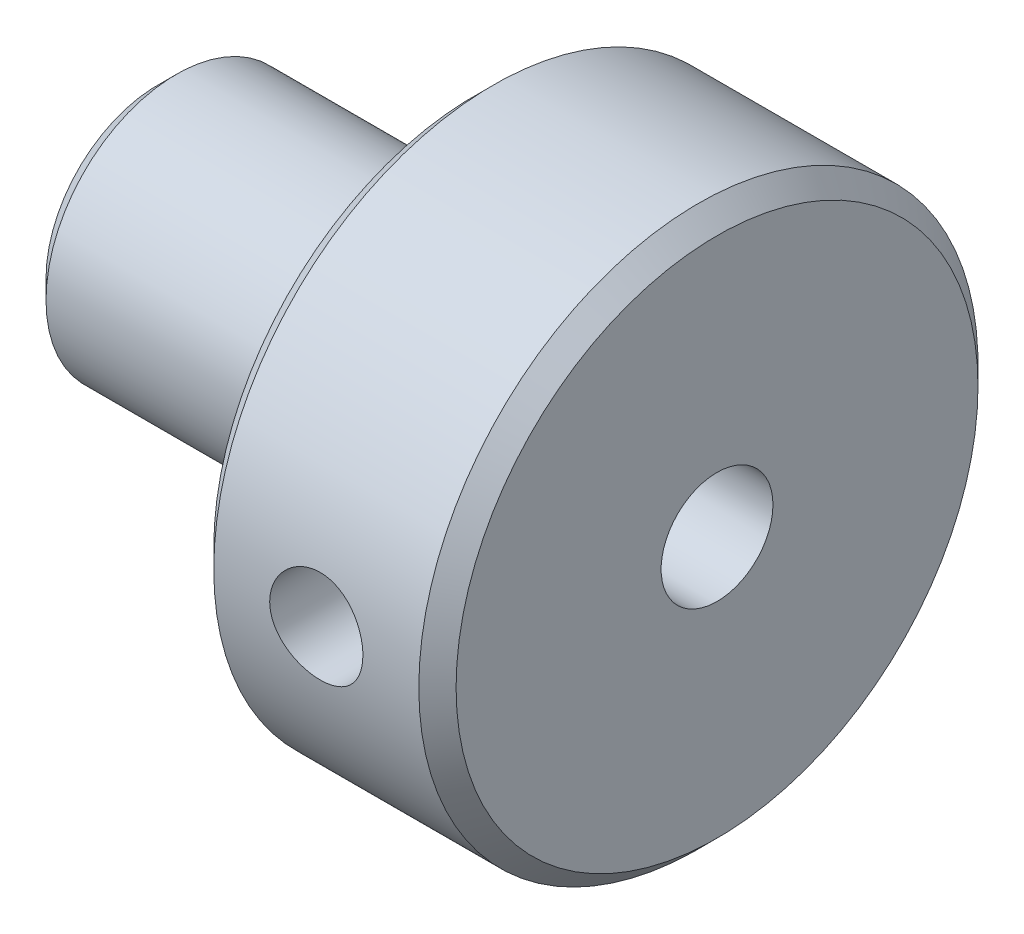
ISO-10303-21;
HEADER;
FILE_DESCRIPTION(('STEP AP214'),'2;1');
FILE_NAME('part.step','',(''),(''),'','','');
FILE_SCHEMA(('AUTOMOTIVE_DESIGN { 1 0 10303 214 1 1 1 1 }'));
ENDSEC;
DATA;
#1=APPLICATION_CONTEXT('core data for automotive mechanical design processes');
#2=APPLICATION_PROTOCOL_DEFINITION('international standard','automotive_design',2000,#1);
#3=PRODUCT_CONTEXT('',#1,'mechanical');
#4=PRODUCT('Part','Part','',(#3));
#5=PRODUCT_RELATED_PRODUCT_CATEGORY('part','',(#4));
#6=PRODUCT_DEFINITION_FORMATION('','',#4);
#7=PRODUCT_DEFINITION_CONTEXT('part definition',#1,'design');
#8=PRODUCT_DEFINITION('design','',#6,#7);
#9=PRODUCT_DEFINITION_SHAPE('','',#8);
#10=(LENGTH_UNIT() NAMED_UNIT(*) SI_UNIT(.MILLI.,.METRE.));
#11=(NAMED_UNIT(*) PLANE_ANGLE_UNIT() SI_UNIT($,.RADIAN.));
#12=(NAMED_UNIT(*) SI_UNIT($,.STERADIAN.) SOLID_ANGLE_UNIT());
#13=UNCERTAINTY_MEASURE_WITH_UNIT(LENGTH_MEASURE(1.E-05),#10,'distance_accuracy_value','');
#14=(GEOMETRIC_REPRESENTATION_CONTEXT(3) GLOBAL_UNCERTAINTY_ASSIGNED_CONTEXT((#13)) GLOBAL_UNIT_ASSIGNED_CONTEXT((#10,
#11,#12)) REPRESENTATION_CONTEXT('',''));
#15=CARTESIAN_POINT('',(0.,0.,0.));
#16=DIRECTION('',(0.,0.,1.));
#17=DIRECTION('',(1.,0.,0.));
#18=AXIS2_PLACEMENT_3D('',#15,#16,#17);
#19=CARTESIAN_POINT('',(12.,0.,0.));
#20=DIRECTION('',(1.,0.,0.));
#21=DIRECTION('',(0.,0.,-1.));
#22=AXIS2_PLACEMENT_3D('',#19,#20,#21);
#23=CONICAL_SURFACE('',#22,1.5,1.02974425867665);
#24=CARTESIAN_POINT('',(12.,0.,0.));
#25=DIRECTION('',(1.,0.,0.));
#26=DIRECTION('',(0.,0.,-1.));
#27=AXIS2_PLACEMENT_3D('',#24,#25,#26);
#28=CIRCLE('',#27,1.5);
#29=CARTESIAN_POINT('',(12.,1.22474487139158,-0.866025403784387));
#30=VERTEX_POINT('',#29);
#31=CARTESIAN_POINT('',(12.,1.22474487139158,0.86602540378438));
#32=VERTEX_POINT('',#31);
#33=EDGE_CURVE('E150',#30,#32,#28,.T.);
#34=ORIENTED_EDGE('',*,*,#33,.T.);
#35=CARTESIAN_POINT('',(12.0903290928541,1.20277849521725,1.13000992327246));
#36=CARTESIAN_POINT('',(12.0726709393552,1.207780261198,1.08173671480113));
#37=CARTESIAN_POINT('',(12.055465042387,1.21222328298894,1.03323553354087));
#38=CARTESIAN_POINT('',(12.0222688610693,1.22010554615955,0.935708084563557));
#39=CARTESIAN_POINT('',(12.0062792759134,1.22354421336571,0.886681533037432));
#40=CARTESIAN_POINT('',(11.9757051422171,1.2295540438813,0.787627333599846));
#41=CARTESIAN_POINT('',(11.9611351611816,1.23211677760813,0.737594609868152));
#42=CARTESIAN_POINT('',(11.9339984280022,1.23645962427981,0.636970096007255));
#43=CARTESIAN_POINT('',(11.9214313946502,1.23823984714875,0.586378385426606));
#44=CARTESIAN_POINT('',(11.8885579137259,1.24248982244376,0.438507900738185));
#45=CARTESIAN_POINT('',(11.8715362972373,1.24412617882776,0.340402103935049));
#46=CARTESIAN_POINT('',(11.8554351857621,1.24555610808899,0.192455729296244));
#47=CARTESIAN_POINT('',(11.8516381332759,1.24586241998786,0.143116629639939));
#48=CARTESIAN_POINT('',(11.8473916638511,1.24620241589911,0.0442893328968177));
#49=CARTESIAN_POINT('',(11.8469419909312,1.24623612075836,-0.00519885249954363));
#50=CARTESIAN_POINT('',(11.8493164928811,1.24604852122718,-0.0997396529202935));
#51=CARTESIAN_POINT('',(11.8518564160113,1.24584936821413,-0.144799848791723));
#52=CARTESIAN_POINT('',(11.8595994427884,1.24519186445326,-0.23469248591188));
#53=CARTESIAN_POINT('',(11.8648031217615,1.24473345770878,-0.279524875844917));
#54=CARTESIAN_POINT('',(11.8840655529884,1.2428571370959,-0.413847678037669));
#55=CARTESIAN_POINT('',(11.9017636190825,1.24093782523646,-0.502819570822946));
#56=CARTESIAN_POINT('',(11.9340141353927,1.23643153721397,-0.636890825517909));
#57=CARTESIAN_POINT('',(11.9460395264198,1.23459986237526,-0.682671625257696));
#58=CARTESIAN_POINT('',(11.9716433411002,1.23026139630203,-0.773774506696456));
#59=CARTESIAN_POINT('',(11.9852219115146,1.22775454123889,-0.819096544605541));
#60=CARTESIAN_POINT('',(12.0135084967134,1.22199401778531,-0.908925089979669));
#61=CARTESIAN_POINT('',(12.0282063577758,1.21874662973513,-0.953435236221209));
#62=CARTESIAN_POINT('',(12.0585868598887,1.21141256629929,-1.04202977060238));
#63=CARTESIAN_POINT('',(12.0742691184114,1.20732621554225,-1.08611431653643));
#64=CARTESIAN_POINT('',(12.0903290928541,1.20277849521725,-1.13000992327246));
#65=B_SPLINE_CURVE_WITH_KNOTS('',3,(#35,#36,#37,#38,#39,#40,#41,#42,#43,#44,#45,#46,#47,#48,#49,
#50,#51,#52,#53,#54,#55,#56,#57,#58,#59,#60,#61,#62,#63,#64),.UNSPECIFIED.,.F.,.F.,(4,2,2,2,2,2,
2,2,2,2,2,2,2,2,4),(0.,0.154933250869943,0.30995490202225,0.466428967443399,0.622881044963881,
0.920883529748979,1.06924390241435,1.21759292953019,1.35290417246563,1.48824465268112,
1.75995275217618,1.90204235011993,2.04414538532002,2.18508535616897,2.32597089407399),.UNSPECIFIED.);
#66=EDGE_CURVE('E109',#32,#30,#65,.T.);
#67=ORIENTED_EDGE('',*,*,#66,.T.);
#68=EDGE_LOOP('',(#34,#67));
#69=FACE_BOUND('',#68,.T.);
#70=ADVANCED_FACE('F39',(#69),#23,.F.);
#71=CARTESIAN_POINT('',(0.,0.,0.));
#72=DIRECTION('',(1.,0.,0.));
#73=DIRECTION('',(0.,0.,-1.));
#74=AXIS2_PLACEMENT_3D('',#71,#72,#73);
#75=PLANE('',#74);
#76=CARTESIAN_POINT('',(0.,0.,0.));
#77=DIRECTION('',(1.,0.,0.));
#78=DIRECTION('',(0.,0.,-1.));
#79=AXIS2_PLACEMENT_3D('',#76,#77,#78);
#80=CIRCLE('',#79,3.);
#81=CARTESIAN_POINT('',(0.,0.,-3.));
#82=VERTEX_POINT('',#81);
#83=EDGE_CURVE('E197',#82,#82,#80,.F.);
#84=ORIENTED_EDGE('',*,*,#83,.T.);
#85=EDGE_LOOP('',(#84));
#86=FACE_BOUND('',#85,.T.);
#87=CARTESIAN_POINT('',(0.,0.,0.));
#88=DIRECTION('',(-1.,0.,0.));
#89=DIRECTION('',(0.,0.,1.));
#90=AXIS2_PLACEMENT_3D('',#87,#88,#89);
#91=CIRCLE('',#90,1.24999999999999);
#92=CARTESIAN_POINT('',(0.,0.,1.24999999999999));
#93=VERTEX_POINT('',#92);
#94=EDGE_CURVE('E153',#93,#93,#91,.T.);
#95=ORIENTED_EDGE('',*,*,#94,.F.);
#96=EDGE_LOOP('',(#95));
#97=FACE_BOUND('',#96,.T.);
#98=ADVANCED_FACE('F170',(#86,#97),#75,.F.);
#99=CARTESIAN_POINT('',(0.,0.,0.));
#100=DIRECTION('',(-1.,0.,0.));
#101=DIRECTION('',(0.,0.,1.));
#102=AXIS2_PLACEMENT_3D('',#99,#100,#101);
#103=CYLINDRICAL_SURFACE('',#102,3.5);
#104=CARTESIAN_POINT('',(0.500000000000003,0.,0.));
#105=DIRECTION('',(1.,0.,0.));
#106=DIRECTION('',(0.,0.,-1.));
#107=AXIS2_PLACEMENT_3D('',#104,#105,#106);
#108=CIRCLE('',#107,3.5);
#109=CARTESIAN_POINT('',(0.500000000000003,0.,-3.5));
#110=VERTEX_POINT('',#109);
#111=EDGE_CURVE('E47',#110,#110,#108,.T.);
#112=ORIENTED_EDGE('',*,*,#111,.T.);
#113=EDGE_LOOP('',(#112));
#114=FACE_BOUND('',#113,.T.);
#115=CARTESIAN_POINT('',(8.5,0.,0.));
#116=DIRECTION('',(-1.,0.,0.));
#117=DIRECTION('',(0.,0.,1.));
#118=AXIS2_PLACEMENT_3D('',#115,#116,#117);
#119=CIRCLE('',#118,3.5);
#120=CARTESIAN_POINT('',(8.5,0.,3.5));
#121=VERTEX_POINT('',#120);
#122=EDGE_CURVE('E158',#121,#121,#119,.T.);
#123=ORIENTED_EDGE('',*,*,#122,.T.);
#124=EDGE_LOOP('',(#123));
#125=FACE_BOUND('',#124,.T.);
#126=ADVANCED_FACE('F174',(#114,#125),#103,.T.);
#127=CARTESIAN_POINT('',(8.5,3.5,0.));
#128=DIRECTION('',(1.,0.,0.));
#129=DIRECTION('',(0.,0.,-1.));
#130=AXIS2_PLACEMENT_3D('',#127,#128,#129);
#131=PLANE('',#130);
#132=CARTESIAN_POINT('',(8.5,0.,0.));
#133=DIRECTION('',(1.,0.,0.));
#134=DIRECTION('',(0.,0.,-1.));
#135=AXIS2_PLACEMENT_3D('',#132,#133,#134);
#136=CIRCLE('',#135,7.);
#137=CARTESIAN_POINT('',(8.5,0.,-7.));
#138=VERTEX_POINT('',#137);
#139=EDGE_CURVE('E11',#138,#138,#136,.F.);
#140=ORIENTED_EDGE('',*,*,#139,.T.);
#141=EDGE_LOOP('',(#140));
#142=FACE_BOUND('',#141,.T.);
#143=ORIENTED_EDGE('',*,*,#122,.F.);
#144=EDGE_LOOP('',(#143));
#145=FACE_BOUND('',#144,.T.);
#146=ADVANCED_FACE('F138',(#142,#145),#131,.F.);
#147=CARTESIAN_POINT('',(0.,0.,0.));
#148=DIRECTION('',(-1.,0.,0.));
#149=DIRECTION('',(0.,0.,1.));
#150=AXIS2_PLACEMENT_3D('',#147,#148,#149);
#151=CYLINDRICAL_SURFACE('',#150,7.5);
#152=CARTESIAN_POINT('',(14.5,0.,0.));
#153=DIRECTION('',(-1.,0.,0.));
#154=DIRECTION('',(0.,0.,1.));
#155=AXIS2_PLACEMENT_3D('',#152,#153,#154);
#156=CIRCLE('',#155,7.5);
#157=CARTESIAN_POINT('',(14.5,0.,7.5));
#158=VERTEX_POINT('',#157);
#159=EDGE_CURVE('E201',#158,#158,#156,.T.);
#160=ORIENTED_EDGE('',*,*,#159,.T.);
#161=EDGE_LOOP('',(#160));
#162=FACE_BOUND('',#161,.T.);
#163=CARTESIAN_POINT('',(9.,0.,0.));
#164=DIRECTION('',(1.,0.,0.));
#165=DIRECTION('',(0.,0.,-1.));
#166=AXIS2_PLACEMENT_3D('',#163,#164,#165);
#167=CIRCLE('',#166,7.5);
#168=CARTESIAN_POINT('',(9.,0.,-7.5));
#169=VERTEX_POINT('',#168);
#170=EDGE_CURVE('E115',#169,#169,#167,.T.);
#171=ORIENTED_EDGE('',*,*,#170,.T.);
#172=EDGE_LOOP('',(#171));
#173=FACE_BOUND('',#172,.T.);
#174=CARTESIAN_POINT('',(13.,0.,7.5));
#175=CARTESIAN_POINT('',(12.9999972055261,-0.069695452479107,7.49999880584412));
#176=CARTESIAN_POINT('',(12.9941513625155,-0.13942894091941,7.49901838956517));
#177=CARTESIAN_POINT('',(12.9709321706173,-0.27694011083652,7.49520172470694));
#178=CARTESIAN_POINT('',(12.9535482215442,-0.344715933979622,7.49236376961945));
#179=CARTESIAN_POINT('',(12.9077922757036,-0.47630237360632,7.48515034118225));
#180=CARTESIAN_POINT('',(12.8794292671797,-0.540116184215947,7.48077612579597));
#181=CARTESIAN_POINT('',(12.8125438539738,-0.662070920988969,7.47097113541035));
#182=CARTESIAN_POINT('',(12.7740226112585,-0.720212494939292,7.46554048127217));
#183=CARTESIAN_POINT('',(12.6875224580898,-0.829736307145836,7.45416658729156));
#184=CARTESIAN_POINT('',(12.6394654426819,-0.881056451767479,7.44821935907428));
#185=CARTESIAN_POINT('',(12.5354260157636,-0.974944249329959,7.43651313438366));
#186=CARTESIAN_POINT('',(12.4794431042717,-1.01751134969548,7.43075414981334));
#187=CARTESIAN_POINT('',(12.3607145169015,-1.09293356280256,7.4200378287989));
#188=CARTESIAN_POINT('',(12.2979293315976,-1.1257272764305,7.41508564545818));
#189=CARTESIAN_POINT('',(12.1676452178497,-1.1802791827056,7.40659894897337));
#190=CARTESIAN_POINT('',(12.1001466081612,-1.2020381207828,7.40306434007154));
#191=CARTESIAN_POINT('',(11.9630098625717,-1.2337071888924,7.39785268421378));
#192=CARTESIAN_POINT('',(11.8933971317493,-1.24372451456769,7.3961588424285));
#193=CARTESIAN_POINT('',(11.7534598615583,-1.25195836264493,7.39476969468325));
#194=CARTESIAN_POINT('',(11.6831353729164,-1.25017572019449,7.39507424728607));
#195=CARTESIAN_POINT('',(11.5445360693623,-1.23494754919807,7.39763214431778));
#196=CARTESIAN_POINT('',(11.4762475982274,-1.22162244094488,7.39986536659458));
#197=CARTESIAN_POINT('',(11.3428893410854,-1.18387657020171,7.40599747605504));
#198=CARTESIAN_POINT('',(11.2778196655557,-1.15945542715986,7.40989642036636));
#199=CARTESIAN_POINT('',(11.1523855882795,-1.10008862304695,7.4189423966705));
#200=CARTESIAN_POINT('',(11.0920452969594,-1.06509295693985,7.42409533553663));
#201=CARTESIAN_POINT('',(10.9780477997308,-0.985606008778711,7.43506459207504));
#202=CARTESIAN_POINT('',(10.9243911337725,-0.941113960327138,7.44088096327143));
#203=CARTESIAN_POINT('',(10.8245869570963,-0.843241106079521,7.45261013939893));
#204=CARTESIAN_POINT('',(10.77854074073,-0.789756981936558,7.45852324615826));
#205=CARTESIAN_POINT('',(10.6960611186673,-0.675767624490818,7.46971300698362));
#206=CARTESIAN_POINT('',(10.6596277749084,-0.615262345953206,7.47498965694873));
#207=CARTESIAN_POINT('',(10.5973988864319,-0.488852958083351,7.48431946446456));
#208=CARTESIAN_POINT('',(10.5716122903344,-0.422944362782327,7.48837159203724));
#209=CARTESIAN_POINT('',(10.531502892377,-0.287649172801363,7.4947875150633));
#210=CARTESIAN_POINT('',(10.5171791315131,-0.218262869589732,7.49715145175237));
#211=CARTESIAN_POINT('',(10.5005393207694,-0.0788549506508107,7.49990564921343));
#212=CARTESIAN_POINT('',(10.4980842140972,-0.00885036857550487,7.50031876506392));
#213=CARTESIAN_POINT('',(10.5048806722141,0.130569886444944,7.49918737210585));
#214=CARTESIAN_POINT('',(10.5141317865669,0.199985581946019,7.49764293862059));
#215=CARTESIAN_POINT('',(10.5439624246677,0.335828087773381,7.49278413469101));
#216=CARTESIAN_POINT('',(10.5644731041951,0.402270434192688,7.48948052400655));
#217=CARTESIAN_POINT('',(10.6161672590998,0.530773442430219,7.48147232227679));
#218=CARTESIAN_POINT('',(10.6473513338176,0.592833857954857,7.4767676525601));
#219=CARTESIAN_POINT('',(10.7198255623484,0.711415344734477,7.46642258151204));
#220=CARTESIAN_POINT('',(10.7612025780836,0.767882625468572,7.46077427943511));
#221=CARTESIAN_POINT('',(10.8527686576925,0.873121792751341,7.4491923369595));
#222=CARTESIAN_POINT('',(10.9029583616383,0.921893119848288,7.44325867585773));
#223=CARTESIAN_POINT('',(11.0113487740357,1.010871389829,7.43170087617923));
#224=CARTESIAN_POINT('',(11.0696270827572,1.05098438055685,7.42608058068553));
#225=CARTESIAN_POINT('',(11.1921764845693,1.12085115514749,7.41585764888942));
#226=CARTESIAN_POINT('',(11.2564473876138,1.15060526738491,7.4112549803301));
#227=CARTESIAN_POINT('',(11.3888948664061,1.19876916573657,7.40361726848852));
#228=CARTESIAN_POINT('',(11.4570540475152,1.21722571627397,7.40057577155532));
#229=CARTESIAN_POINT('',(11.5955600646109,1.24241772688913,7.39638858417631));
#230=CARTESIAN_POINT('',(11.665906709866,1.24915420597308,7.39524272891361));
#231=CARTESIAN_POINT('',(11.8058525829812,1.25068643302367,7.39498366542006));
#232=CARTESIAN_POINT('',(11.8754501892876,1.24563006806259,7.39584528252825));
#233=CARTESIAN_POINT('',(12.0127896240254,1.22403991947842,7.39944890726864));
#234=CARTESIAN_POINT('',(12.0805314584709,1.20750617305623,7.40219090880607));
#235=CARTESIAN_POINT('',(12.2121792186463,1.16348724479744,7.40923678140859));
#236=CARTESIAN_POINT('',(12.276089505028,1.13601479530021,7.41353883609835));
#237=CARTESIAN_POINT('',(12.3984178345974,1.07091350195795,7.42322184461104));
#238=CARTESIAN_POINT('',(12.4568356051861,1.03328415437428,7.428602851942));
#239=CARTESIAN_POINT('',(12.5672677915539,0.948409442186072,7.43991727022811));
#240=CARTESIAN_POINT('',(12.6191980083501,0.901055281796818,7.44585647788151));
#241=CARTESIAN_POINT('',(12.7144258022375,0.798304515690109,7.45757186180421));
#242=CARTESIAN_POINT('',(12.7577213843191,0.742906056456313,7.46334800013273));
#243=CARTESIAN_POINT('',(12.8347241341,0.625184584820136,7.4741326482111));
#244=CARTESIAN_POINT('',(12.8683630196565,0.562816393766404,7.47913558126552));
#245=CARTESIAN_POINT('',(12.924634742305,0.433256534689487,7.48775583800888));
#246=CARTESIAN_POINT('',(12.9472785405398,0.366069747415001,7.49137454088741));
#247=CARTESIAN_POINT('',(12.9760026370633,0.248851655022698,7.49602895416478));
#248=CARTESIAN_POINT('',(12.984987234808,0.199529415149221,7.49751013636679));
#249=CARTESIAN_POINT('',(12.9969868689224,0.100144655159903,7.4994960799306));
#250=CARTESIAN_POINT('',(13.0000020080687,0.0500821478042464,7.50000085810321));
#251=CARTESIAN_POINT('',(13.,0.,7.5));
#252=B_SPLINE_CURVE_WITH_KNOTS('',3,(#174,#175,#176,#177,#178,#179,#180,#181,#182,#183,#184,
#185,#186,#187,#188,#189,#190,#191,#192,#193,#194,#195,#196,#197,#198,#199,#200,#201,#202,#203,
#204,#205,#206,#207,#208,#209,#210,#211,#212,#213,#214,#215,#216,#217,#218,#219,#220,#221,#222,
#223,#224,#225,#226,#227,#228,#229,#230,#231,#232,#233,#234,#235,#236,#237,#238,#239,#240,#241,
#242,#243,#244,#245,#246,#247,#248,#249,#250,#251),.UNSPECIFIED.,.T.,.F.,(4,2,2,2,2,2,2,2,2,2,2,
2,2,2,2,2,2,2,2,2,2,2,2,2,2,2,2,2,2,2,2,2,2,2,2,2,2,2,4),(0.,0.208903292469254,
0.417998772847708,0.626923433512632,0.835824206337391,1.04651245531165,1.25721400084928,
1.46921260411919,1.6811968843809,1.89123038551711,2.10124902160442,2.30910260880203,
2.51696332512689,2.72582278316277,2.93469910340285,3.14616384955662,3.35762995817922,
3.5692734445795,3.78089922260572,3.99003941745696,4.19917156517928,4.40703903503205,
4.61491817913031,4.8246341281351,5.03436531527139,5.24626911003807,5.45816618687969,
5.66918011170883,5.88017568893306,6.08853954761347,6.29690273094063,6.50502409113108,
6.71315577514665,6.92375692096692,7.13440666939482,7.34651115803596,7.55840376065032,
7.70852124082005,7.8586361363848),.UNSPECIFIED.);
#253=CARTESIAN_POINT('',(13.,0.,7.5));
#254=VERTEX_POINT('',#253);
#255=EDGE_CURVE('E141',#254,#254,#252,.T.);
#256=ORIENTED_EDGE('',*,*,#255,.T.);
#257=EDGE_LOOP('',(#256));
#258=FACE_BOUND('',#257,.T.);
#259=ADVANCED_FACE('F133',(#162,#173,#258),#151,.T.);
#260=CARTESIAN_POINT('',(15.,7.5,0.));
#261=DIRECTION('',(-1.,0.,0.));
#262=DIRECTION('',(0.,0.,1.));
#263=AXIS2_PLACEMENT_3D('',#260,#261,#262);
#264=PLANE('',#263);
#265=CARTESIAN_POINT('',(15.,0.,0.));
#266=DIRECTION('',(-1.,0.,0.));
#267=DIRECTION('',(0.,0.,1.));
#268=AXIS2_PLACEMENT_3D('',#265,#266,#267);
#269=CIRCLE('',#268,6.99999999999999);
#270=CARTESIAN_POINT('',(15.,0.,6.99999999999999));
#271=VERTEX_POINT('',#270);
#272=EDGE_CURVE('E198',#271,#271,#269,.F.);
#273=ORIENTED_EDGE('',*,*,#272,.T.);
#274=EDGE_LOOP('',(#273));
#275=FACE_BOUND('',#274,.T.);
#276=CARTESIAN_POINT('',(15.,0.,0.));
#277=DIRECTION('',(1.,0.,0.));
#278=DIRECTION('',(0.,0.,-1.));
#279=AXIS2_PLACEMENT_3D('',#276,#277,#278);
#280=CIRCLE('',#279,1.5);
#281=CARTESIAN_POINT('',(15.,0.,-1.5));
#282=VERTEX_POINT('',#281);
#283=EDGE_CURVE('E146',#282,#282,#280,.T.);
#284=ORIENTED_EDGE('',*,*,#283,.F.);
#285=EDGE_LOOP('',(#284));
#286=FACE_BOUND('',#285,.T.);
#287=ADVANCED_FACE('F130',(#275,#286),#264,.F.);
#288=CARTESIAN_POINT('',(8.,0.,0.));
#289=DIRECTION('',(-1.,0.,0.));
#290=DIRECTION('',(0.,0.,1.));
#291=AXIS2_PLACEMENT_3D('',#288,#289,#290);
#292=CONICAL_SURFACE('',#291,1.25,1.02974425867665);
#293=CARTESIAN_POINT('',(8.75107577378445,0.,0.));
#294=VERTEX_POINT('',#293);
#295=VERTEX_LOOP('',#294);
#296=FACE_BOUND('',#295,.T.);
#297=CARTESIAN_POINT('',(8.,0.,0.));
#298=DIRECTION('',(-1.,0.,0.));
#299=DIRECTION('',(0.,0.,1.));
#300=AXIS2_PLACEMENT_3D('',#297,#298,#299);
#301=CIRCLE('',#300,1.25);
#302=CARTESIAN_POINT('',(8.,0.,1.25));
#303=VERTEX_POINT('',#302);
#304=EDGE_CURVE('E156',#303,#303,#301,.T.);
#305=ORIENTED_EDGE('',*,*,#304,.T.);
#306=EDGE_LOOP('',(#305));
#307=FACE_BOUND('',#306,.T.);
#308=ADVANCED_FACE('F126',(#296,#307),#292,.F.);
#309=CARTESIAN_POINT('',(0.,0.,0.));
#310=DIRECTION('',(-1.,0.,0.));
#311=DIRECTION('',(0.,0.,1.));
#312=AXIS2_PLACEMENT_3D('',#309,#310,#311);
#313=CYLINDRICAL_SURFACE('',#312,1.24999999999999);
#314=ORIENTED_EDGE('',*,*,#304,.F.);
#315=EDGE_LOOP('',(#314));
#316=FACE_BOUND('',#315,.T.);
#317=ORIENTED_EDGE('',*,*,#94,.T.);
#318=EDGE_LOOP('',(#317));
#319=FACE_BOUND('',#318,.T.);
#320=ADVANCED_FACE('F121',(#316,#319),#313,.F.);
#321=CARTESIAN_POINT('',(12.,-1.22474487139158,0.866025403784507));
#322=VERTEX_POINT('',#321);
#323=CARTESIAN_POINT('',(12.,-1.22474487139158,-0.866025403784515));
#324=VERTEX_POINT('',#323);
#325=EDGE_CURVE('E149',#322,#324,#28,.T.);
#326=ORIENTED_EDGE('',*,*,#325,.T.);
#327=CARTESIAN_POINT('',(12.0903290928541,-1.20277849521725,-1.13000992327256));
#328=CARTESIAN_POINT('',(12.0726709393552,-1.20778026119801,-1.08173671480123));
#329=CARTESIAN_POINT('',(12.055465042387,-1.21222328298894,-1.03323553354097));
#330=CARTESIAN_POINT('',(12.0222688610693,-1.22010554615956,-0.935708084563645));
#331=CARTESIAN_POINT('',(12.0062792759134,-1.22354421336571,-0.886681533037518));
#332=CARTESIAN_POINT('',(11.9757051422171,-1.2295540438813,-0.787627333599924));
#333=CARTESIAN_POINT('',(11.9611351611815,-1.23211677760814,-0.737594609868225));
#334=CARTESIAN_POINT('',(11.9339984280022,-1.23645962427982,-0.63697009600732));
#335=CARTESIAN_POINT('',(11.9214313946502,-1.23823984714875,-0.586378385426667));
#336=CARTESIAN_POINT('',(11.8885579137259,-1.24248982244377,-0.438507900738234));
#337=CARTESIAN_POINT('',(11.8715362972373,-1.24412617882777,-0.340402103935091));
#338=CARTESIAN_POINT('',(11.8554351857621,-1.245556108089,-0.192455729296275));
#339=CARTESIAN_POINT('',(11.8516381332759,-1.24586241998786,-0.143116629639966));
#340=CARTESIAN_POINT('',(11.847391663851,-1.24620241589912,-0.0442893328968366));
#341=CARTESIAN_POINT('',(11.8469419909312,-1.24623612075837,0.00519885249952859));
#342=CARTESIAN_POINT('',(11.8493164928811,-1.24604852122719,0.0997396529202867));
#343=CARTESIAN_POINT('',(11.8518564160113,-1.24584936821413,0.14479984879172));
#344=CARTESIAN_POINT('',(11.8595994427883,-1.24519186445327,0.234692485911886));
#345=CARTESIAN_POINT('',(11.8648031217614,-1.24473345770878,0.279524875844927));
#346=CARTESIAN_POINT('',(11.8840655529884,-1.2428571370959,0.413847678037692));
#347=CARTESIAN_POINT('',(11.9017636190824,-1.24093782523646,0.502819570822977));
#348=CARTESIAN_POINT('',(11.9340141353927,-1.23643153721398,0.636890825517952));
#349=CARTESIAN_POINT('',(11.9460395264198,-1.23459986237526,0.682671625257743));
#350=CARTESIAN_POINT('',(11.9716433411002,-1.23026139630204,0.773774506696512));
#351=CARTESIAN_POINT('',(11.9852219115146,-1.2277545412389,0.819096544605602));
#352=CARTESIAN_POINT('',(12.0135084967133,-1.22199401778531,0.908925089979738));
#353=CARTESIAN_POINT('',(12.0282063577758,-1.21874662973513,0.953435236221281));
#354=CARTESIAN_POINT('',(12.0585868598887,-1.21141256629929,1.04202977060246));
#355=CARTESIAN_POINT('',(12.0742691184114,-1.20732621554225,1.08611431653652));
#356=CARTESIAN_POINT('',(12.0903290928541,-1.20277849521725,1.13000992327255));
#357=B_SPLINE_CURVE_WITH_KNOTS('',3,(#327,#328,#329,#330,#331,#332,#333,#334,#335,#336,#337,
#338,#339,#340,#341,#342,#343,#344,#345,#346,#347,#348,#349,#350,#351,#352,#353,#354,#355,#356),
.UNSPECIFIED.,.F.,.F.,(4,2,2,2,2,2,2,2,2,2,2,2,2,2,4),(0.,0.154933250869957,0.309954902022277,
0.46642896744344,0.622881044963937,0.920883529749059,1.06924390241444,1.21759292953029,
1.35290417246575,1.48824465268125,1.75995275217634,1.9020423501201,2.04414538532021,
2.18508535616916,2.32597089407421),.UNSPECIFIED.);
#358=EDGE_CURVE('E101',#324,#322,#357,.T.);
#359=ORIENTED_EDGE('',*,*,#358,.T.);
#360=EDGE_LOOP('',(#326,#359));
#361=FACE_BOUND('',#360,.T.);
#362=ADVANCED_FACE('F117',(#361),#23,.F.);
#363=CARTESIAN_POINT('',(15.,0.,0.));
#364=DIRECTION('',(1.,0.,0.));
#365=DIRECTION('',(0.,0.,-1.));
#366=AXIS2_PLACEMENT_3D('',#363,#364,#365);
#367=CYLINDRICAL_SURFACE('',#366,1.5);
#368=ORIENTED_EDGE('',*,*,#325,.F.);
#369=CARTESIAN_POINT('',(12.,-1.22474487139158,0.866025403784507));
#370=CARTESIAN_POINT('',(12.0354216053636,-1.21750587465049,0.876272927374335));
#371=CARTESIAN_POINT('',(12.0699717644657,-1.20886151882577,0.888219059635566));
#372=CARTESIAN_POINT('',(12.1372334015033,-1.18902522451932,0.914595186486231));
#373=CARTESIAN_POINT('',(12.1699501553079,-1.17784111948153,0.929017510977259));
#374=CARTESIAN_POINT('',(12.2335098323675,-1.15320158335883,0.959431564450944));
#375=CARTESIAN_POINT('',(12.2643610917661,-1.13975745827047,0.975415323188356));
#376=CARTESIAN_POINT('',(12.3244668783699,-1.11067664530152,1.00840582785005));
#377=CARTESIAN_POINT('',(12.3537200137486,-1.09503808725809,1.02541343919883));
#378=CARTESIAN_POINT('',(12.4384828806493,-1.0453490958362,1.0767958552462));
#379=CARTESIAN_POINT('',(12.4917660416955,-1.00822055035265,1.11192658114047));
#380=CARTESIAN_POINT('',(12.5923640601927,-0.925824902436491,1.18142647310882));
#381=CARTESIAN_POINT('',(12.6396683667421,-0.880543745164539,1.2157942070272));
#382=CARTESIAN_POINT('',(12.7259860055461,-0.783589457668674,1.28033578817904));
#383=CARTESIAN_POINT('',(12.7652315852721,-0.732195537319527,1.31061432497499));
#384=CARTESIAN_POINT('',(12.8361651617527,-0.622105672349797,1.36629962337212));
#385=CARTESIAN_POINT('',(12.8678665097716,-0.563422911491099,1.39171497564193));
#386=CARTESIAN_POINT('',(12.9172618769887,-0.450645420102562,1.4317231704523));
#387=CARTESIAN_POINT('',(12.9364470122667,-0.397606896286718,1.44743861510449));
#388=CARTESIAN_POINT('',(12.9676689380708,-0.288123739866998,1.47313898234438));
#389=CARTESIAN_POINT('',(12.9797097375995,-0.231681037125997,1.48312711867209));
#390=CARTESIAN_POINT('',(12.9959075298585,-0.116628009080966,1.49658441978123));
#391=CARTESIAN_POINT('',(13.0000288721901,-0.0580090870966637,1.50002410527659));
#392=CARTESIAN_POINT('',(12.9999708332756,0.0592226836939919,1.49997564928064));
#393=CARTESIAN_POINT('',(12.9957919095411,0.117835532657002,1.49648788963081));
#394=CARTESIAN_POINT('',(12.9800519013382,0.228884448212169,1.48341183145663));
#395=CARTESIAN_POINT('',(12.9690539007559,0.281458497821199,1.47428904365955));
#396=CARTESIAN_POINT('',(12.9408303766052,0.383716494392825,1.45103866957798));
#397=CARTESIAN_POINT('',(12.9236047218568,0.433400380451107,1.43691097786978));
#398=CARTESIAN_POINT('',(12.8821385394936,0.532811197376871,1.40323885028985));
#399=CARTESIAN_POINT('',(12.8574539478389,0.582236160122879,1.38335659580039));
#400=CARTESIAN_POINT('',(12.8026803347793,0.676262906480299,1.33990984838492));
#401=CARTESIAN_POINT('',(12.7725842972413,0.720858306671783,1.31634058033295));
#402=CARTESIAN_POINT('',(12.6923014211143,0.825062293766038,1.2547819286265));
#403=CARTESIAN_POINT('',(12.6393817451863,0.881676635983877,1.21527941725502));
#404=CARTESIAN_POINT('',(12.5250307174186,0.983727118285136,1.13424581662654));
#405=CARTESIAN_POINT('',(12.463596514991,1.02915950054828,1.09271405102086));
#406=CARTESIAN_POINT('',(12.3684993914932,1.08680550635383,1.03417200381672));
#407=CARTESIAN_POINT('',(12.3381040627294,1.10356383065478,1.01621591915212));
#408=CARTESIAN_POINT('',(12.275568246742,1.13467967384301,0.98134910306046));
#409=CARTESIAN_POINT('',(12.2434295611022,1.14903961088655,0.964437329693922));
#410=CARTESIAN_POINT('',(12.1772405970756,1.17525952305289,0.932305544529751));
#411=CARTESIAN_POINT('',(12.1431875832451,1.18711579940477,0.917088051231688));
#412=CARTESIAN_POINT('',(12.0730793967172,1.20807972215753,0.889300187038526));
#413=CARTESIAN_POINT('',(12.0370178597265,1.21717796503359,0.876738915593816));
#414=CARTESIAN_POINT('',(12.,1.22474487139158,0.86602540378438));
#415=B_SPLINE_CURVE_WITH_KNOTS('',3,(#369,#370,#371,#372,#373,#374,#375,#376,#377,#378,#379,
#380,#381,#382,#383,#384,#385,#386,#387,#388,#389,#390,#391,#392,#393,#394,#395,#396,#397,#398,
#399,#400,#401,#402,#403,#404,#405,#406,#407,#408,#409,#410,#411,#412,#413,#414),.UNSPECIFIED.,
.F.,.F.,(4,2,2,2,2,2,2,2,2,2,2,2,2,2,2,2,2,2,2,2,2,2,4),(0.,0.112534014298699,0.224725539790583,
0.336371664197168,0.448113521336944,0.668868947524093,0.89000865795388,1.10340798350199,
1.31642679334205,1.49135145495252,1.66617786554219,1.84178945152304,2.01739135804425,
2.1801322187292,2.34287650760509,2.51837906323501,2.69411082686763,2.95372270697519,
3.21342171373962,3.33056104691881,3.44758155278563,3.56477374720285,3.68236112754679),.UNSPECIFIED.);
#416=EDGE_CURVE('E54',#322,#32,#415,.T.);
#417=ORIENTED_EDGE('',*,*,#416,.T.);
#418=ORIENTED_EDGE('',*,*,#33,.F.);
#419=CARTESIAN_POINT('',(12.,1.22474487139158,-0.866025403784387));
#420=CARTESIAN_POINT('',(12.0354216053636,1.21750587465049,-0.876272927374217));
#421=CARTESIAN_POINT('',(12.0699717644657,1.20886151882577,-0.888219059635451));
#422=CARTESIAN_POINT('',(12.1372334015033,1.18902522451932,-0.914595186486122));
#423=CARTESIAN_POINT('',(12.1699501553079,1.17784111948153,-0.929017510977152));
#424=CARTESIAN_POINT('',(12.2335098323675,1.15320158335883,-0.959431564450844));
#425=CARTESIAN_POINT('',(12.2643610917661,1.13975745827047,-0.975415323188258));
#426=CARTESIAN_POINT('',(12.3244668783699,1.11067664530152,-1.00840582784995));
#427=CARTESIAN_POINT('',(12.3537200137486,1.09503808725809,-1.02541343919874));
#428=CARTESIAN_POINT('',(12.4384828806493,1.0453490958362,-1.07679585524612));
#429=CARTESIAN_POINT('',(12.4917660416955,1.00822055035265,-1.1119265811404));
#430=CARTESIAN_POINT('',(12.5923640601927,0.925824902436491,-1.18142647310876));
#431=CARTESIAN_POINT('',(12.6396683667421,0.880543745164541,-1.21579420702714));
#432=CARTESIAN_POINT('',(12.7259860055461,0.783589457668675,-1.280335788179));
#433=CARTESIAN_POINT('',(12.7652315852721,0.732195537319527,-1.31061432497494));
#434=CARTESIAN_POINT('',(12.8361651617527,0.622105672349797,-1.36629962337208));
#435=CARTESIAN_POINT('',(12.8678665097716,0.563422911491098,-1.39171497564191));
#436=CARTESIAN_POINT('',(12.9172618769887,0.450645420102561,-1.43172317045228));
#437=CARTESIAN_POINT('',(12.9364470122667,0.397606896286716,-1.44743861510447));
#438=CARTESIAN_POINT('',(12.9676689380708,0.288123739866996,-1.47313898234437));
#439=CARTESIAN_POINT('',(12.9797097375995,0.231681037125994,-1.48312711867208));
#440=CARTESIAN_POINT('',(12.9959075298585,0.116628009080963,-1.49658441978124));
#441=CARTESIAN_POINT('',(13.0000288721901,0.0580090870966595,-1.5000241052766));
#442=CARTESIAN_POINT('',(12.9999708332756,-0.0592226836939981,-1.49997564928065));
#443=CARTESIAN_POINT('',(12.9957919095411,-0.11783553265701,-1.49648788963082));
#444=CARTESIAN_POINT('',(12.9800519013382,-0.228884448212178,-1.48341183145665));
#445=CARTESIAN_POINT('',(12.9690539007559,-0.281458497821209,-1.47428904365958));
#446=CARTESIAN_POINT('',(12.9408303766052,-0.383716494392836,-1.45103866957801));
#447=CARTESIAN_POINT('',(12.9236047218568,-0.433400380451118,-1.43691097786981));
#448=CARTESIAN_POINT('',(12.8821385394936,-0.532811197376884,-1.40323885028988));
#449=CARTESIAN_POINT('',(12.8574539478389,-0.582236160122891,-1.38335659580043));
#450=CARTESIAN_POINT('',(12.8026803347793,-0.676262906480311,-1.33990984838497));
#451=CARTESIAN_POINT('',(12.7725842972413,-0.720858306671794,-1.316340580333));
#452=CARTESIAN_POINT('',(12.6923014211142,-0.825062293766048,-1.25478192862656));
#453=CARTESIAN_POINT('',(12.6393817451863,-0.881676635983885,-1.21527941725508));
#454=CARTESIAN_POINT('',(12.5250307174186,-0.98372711828514,-1.13424581662662));
#455=CARTESIAN_POINT('',(12.463596514991,-1.02915950054829,-1.09271405102094));
#456=CARTESIAN_POINT('',(12.3684993914932,-1.08680550635383,-1.03417200381682));
#457=CARTESIAN_POINT('',(12.3381040627294,-1.10356383065479,-1.01621591915222));
#458=CARTESIAN_POINT('',(12.275568246742,-1.13467967384301,-0.98134910306057));
#459=CARTESIAN_POINT('',(12.2434295611022,-1.14903961088655,-0.964437329694035));
#460=CARTESIAN_POINT('',(12.1772405970756,-1.17525952305289,-0.932305544529871));
#461=CARTESIAN_POINT('',(12.1431875832451,-1.18711579940477,-0.917088051231812));
#462=CARTESIAN_POINT('',(12.0730793967172,-1.20807972215753,-0.889300187038655));
#463=CARTESIAN_POINT('',(12.0370178597265,-1.21717796503359,-0.876738915593948));
#464=CARTESIAN_POINT('',(12.,-1.22474487139158,-0.866025403784515));
#465=B_SPLINE_CURVE_WITH_KNOTS('',3,(#419,#420,#421,#422,#423,#424,#425,#426,#427,#428,#429,
#430,#431,#432,#433,#434,#435,#436,#437,#438,#439,#440,#441,#442,#443,#444,#445,#446,#447,#448,
#449,#450,#451,#452,#453,#454,#455,#456,#457,#458,#459,#460,#461,#462,#463,#464),.UNSPECIFIED.,
.F.,.F.,(4,2,2,2,2,2,2,2,2,2,2,2,2,2,2,2,2,2,2,2,2,2,4),(0.,0.112534014298701,0.224725539790589,
0.336371664197177,0.448113521336958,0.668868947524115,0.890008657953906,1.10340798350203,
1.31642679334209,1.49135145495257,1.66617786554223,1.84178945152309,2.0173913580443,
2.18013221872925,2.34287650760515,2.51837906323506,2.69411082686768,2.95372270697522,
3.21342171373964,3.33056104691882,3.44758155278564,3.56477374720285,3.68236112754679),.UNSPECIFIED.);
#466=EDGE_CURVE('E79',#30,#324,#465,.T.);
#467=ORIENTED_EDGE('',*,*,#466,.T.);
#468=EDGE_LOOP('',(#368,#417,#418,#467));
#469=FACE_BOUND('',#468,.T.);
#470=ORIENTED_EDGE('',*,*,#283,.T.);
#471=EDGE_LOOP('',(#470));
#472=FACE_BOUND('',#471,.T.);
#473=ADVANCED_FACE('F93',(#469,#472),#367,.F.);
#474=CARTESIAN_POINT('',(11.75,0.,7.5));
#475=DIRECTION('',(0.,0.,1.));
#476=DIRECTION('',(1.,0.,0.));
#477=AXIS2_PLACEMENT_3D('',#474,#475,#476);
#478=CYLINDRICAL_SURFACE('',#477,1.24999999999999);
#479=CARTESIAN_POINT('',(11.75,0.,-4.5));
#480=DIRECTION('',(0.,0.,1.));
#481=DIRECTION('',(1.,0.,0.));
#482=AXIS2_PLACEMENT_3D('',#479,#480,#481);
#483=CIRCLE('',#482,1.25);
#484=CARTESIAN_POINT('',(13.,0.,-4.5));
#485=VERTEX_POINT('',#484);
#486=EDGE_CURVE('E77',#485,#485,#483,.T.);
#487=ORIENTED_EDGE('',*,*,#486,.F.);
#488=EDGE_LOOP('',(#487));
#489=FACE_BOUND('',#488,.T.);
#490=ORIENTED_EDGE('',*,*,#416,.F.);
#491=ORIENTED_EDGE('',*,*,#358,.F.);
#492=ORIENTED_EDGE('',*,*,#466,.F.);
#493=ORIENTED_EDGE('',*,*,#66,.F.);
#494=EDGE_LOOP('',(#490,#491,#492,#493));
#495=FACE_BOUND('',#494,.T.);
#496=ORIENTED_EDGE('',*,*,#255,.F.);
#497=EDGE_LOOP('',(#496));
#498=FACE_BOUND('',#497,.T.);
#499=ADVANCED_FACE('F73',(#489,#495,#498),#478,.F.);
#500=CARTESIAN_POINT('',(11.75,0.,-4.5));
#501=DIRECTION('',(0.,0.,1.));
#502=DIRECTION('',(1.,0.,0.));
#503=AXIS2_PLACEMENT_3D('',#500,#501,#502);
#504=CONICAL_SURFACE('',#503,1.25,1.02974425867665);
#505=CARTESIAN_POINT('',(11.75,0.,-5.25107577378445));
#506=VERTEX_POINT('',#505);
#507=VERTEX_LOOP('',#506);
#508=FACE_BOUND('',#507,.T.);
#509=ORIENTED_EDGE('',*,*,#486,.T.);
#510=EDGE_LOOP('',(#509));
#511=FACE_BOUND('',#510,.T.);
#512=ADVANCED_FACE('F69',(#508,#511),#504,.F.);
#513=CARTESIAN_POINT('',(14.5,0.,0.));
#514=DIRECTION('',(-1.,0.,0.));
#515=DIRECTION('',(0.,0.,1.));
#516=AXIS2_PLACEMENT_3D('',#513,#514,#515);
#517=CONICAL_SURFACE('',#516,7.5,0.785398163397449);
#518=ORIENTED_EDGE('',*,*,#272,.F.);
#519=EDGE_LOOP('',(#518));
#520=FACE_BOUND('',#519,.T.);
#521=ORIENTED_EDGE('',*,*,#159,.F.);
#522=EDGE_LOOP('',(#521));
#523=FACE_BOUND('',#522,.T.);
#524=ADVANCED_FACE('F72',(#520,#523),#517,.T.);
#525=CARTESIAN_POINT('',(0.,0.,0.));
#526=DIRECTION('',(1.,0.,0.));
#527=DIRECTION('',(0.,0.,-1.));
#528=AXIS2_PLACEMENT_3D('',#525,#526,#527);
#529=CONICAL_SURFACE('',#528,3.,0.785398163397447);
#530=ORIENTED_EDGE('',*,*,#111,.F.);
#531=EDGE_LOOP('',(#530));
#532=FACE_BOUND('',#531,.T.);
#533=ORIENTED_EDGE('',*,*,#83,.F.);
#534=EDGE_LOOP('',(#533));
#535=FACE_BOUND('',#534,.T.);
#536=ADVANCED_FACE('F185',(#532,#535),#529,.T.);
#537=CARTESIAN_POINT('',(8.5,0.,0.));
#538=DIRECTION('',(1.,0.,0.));
#539=DIRECTION('',(0.,0.,-1.));
#540=AXIS2_PLACEMENT_3D('',#537,#538,#539);
#541=CONICAL_SURFACE('',#540,7.,0.785398163397447);
#542=ORIENTED_EDGE('',*,*,#170,.F.);
#543=EDGE_LOOP('',(#542));
#544=FACE_BOUND('',#543,.T.);
#545=ORIENTED_EDGE('',*,*,#139,.F.);
#546=EDGE_LOOP('',(#545));
#547=FACE_BOUND('',#546,.T.);
#548=ADVANCED_FACE('F41',(#544,#547),#541,.T.);
#549=CLOSED_SHELL('',(#70,#98,#126,#146,#259,#287,#308,#320,#362,#473,#499,#512,#524,#536,#548));
#550=MANIFOLD_SOLID_BREP('B2',#549);
#551=ADVANCED_BREP_SHAPE_REPRESENTATION('',(#18,#550),#14);
#552=SHAPE_DEFINITION_REPRESENTATION(#9,#551);
ENDSEC;
END-ISO-10303-21;
